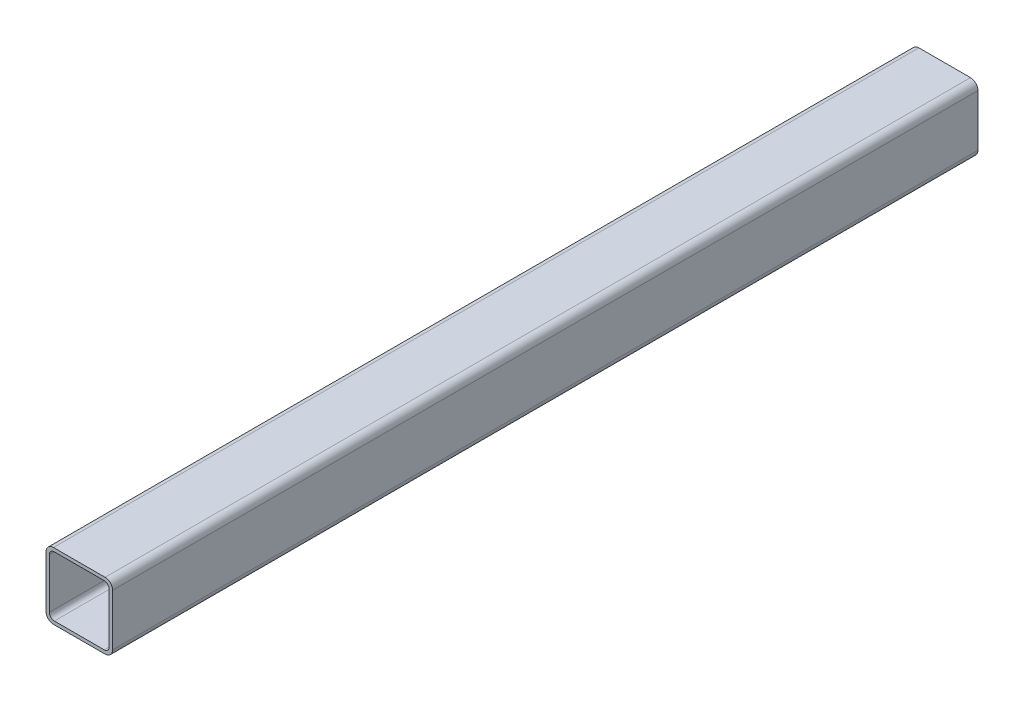
ISO-10303-21;
HEADER;
FILE_DESCRIPTION(('STEP AP214'),'2;1');
FILE_NAME('part.step','',(''),(''),'','','');
FILE_SCHEMA(('AUTOMOTIVE_DESIGN { 1 0 10303 214 1 1 1 1 }'));
ENDSEC;
DATA;
#1=APPLICATION_CONTEXT('core data for automotive mechanical design processes');
#2=APPLICATION_PROTOCOL_DEFINITION('international standard','automotive_design',2000,#1);
#3=PRODUCT_CONTEXT('',#1,'mechanical');
#4=PRODUCT('Part','Part','',(#3));
#5=PRODUCT_RELATED_PRODUCT_CATEGORY('part','',(#4));
#6=PRODUCT_DEFINITION_FORMATION('','',#4);
#7=PRODUCT_DEFINITION_CONTEXT('part definition',#1,'design');
#8=PRODUCT_DEFINITION('design','',#6,#7);
#9=PRODUCT_DEFINITION_SHAPE('','',#8);
#10=(LENGTH_UNIT() NAMED_UNIT(*) SI_UNIT(.MILLI.,.METRE.));
#11=(NAMED_UNIT(*) PLANE_ANGLE_UNIT() SI_UNIT($,.RADIAN.));
#12=(NAMED_UNIT(*) SI_UNIT($,.STERADIAN.) SOLID_ANGLE_UNIT());
#13=UNCERTAINTY_MEASURE_WITH_UNIT(LENGTH_MEASURE(1.E-05),#10,'distance_accuracy_value','');
#14=(GEOMETRIC_REPRESENTATION_CONTEXT(3) GLOBAL_UNCERTAINTY_ASSIGNED_CONTEXT((#13)) GLOBAL_UNIT_ASSIGNED_CONTEXT((#10,
#11,#12)) REPRESENTATION_CONTEXT('',''));
#15=CARTESIAN_POINT('',(0.,0.,0.));
#16=DIRECTION('',(0.,0.,1.));
#17=DIRECTION('',(1.,0.,0.));
#18=AXIS2_PLACEMENT_3D('',#15,#16,#17);
#19=CARTESIAN_POINT('',(-15.4999999999959,1289.,-2383.));
#20=DIRECTION('',(0.,-1.,0.));
#21=DIRECTION('',(0.,0.,-1.));
#22=AXIS2_PLACEMENT_3D('',#19,#20,#21);
#23=PLANE('',#22);
#24=DIRECTION('',(1.,0.,0.));
#25=VECTOR('',#24,1.);
#26=CARTESIAN_POINT('',(-15.5000000000012,1289.,-2363.));
#27=LINE('',#26,#25);
#28=CARTESIAN_POINT('',(-15.5000000000012,1289.,-2363.));
#29=VERTEX_POINT('',#28);
#30=CARTESIAN_POINT('',(15.499999999999,1289.,-2363.));
#31=VERTEX_POINT('',#30);
#32=EDGE_CURVE('E11',#29,#31,#27,.T.);
#33=ORIENTED_EDGE('',*,*,#32,.F.);
#34=DIRECTION('',(0.,0.,1.));
#35=VECTOR('',#34,1.);
#36=CARTESIAN_POINT('',(-15.4999999999959,1289.,-2383.));
#37=LINE('',#36,#35);
#38=CARTESIAN_POINT('',(-15.5000000000012,1289.,-1843.));
#39=VERTEX_POINT('',#38);
#40=EDGE_CURVE('E307',#29,#39,#37,.T.);
#41=ORIENTED_EDGE('',*,*,#40,.T.);
#42=DIRECTION('',(-1.,0.,0.));
#43=VECTOR('',#42,1.);
#44=CARTESIAN_POINT('',(-15.5000000000012,1289.,-1843.));
#45=LINE('',#44,#43);
#46=CARTESIAN_POINT('',(15.499999999999,1289.,-1843.));
#47=VERTEX_POINT('',#46);
#48=EDGE_CURVE('E246',#47,#39,#45,.T.);
#49=ORIENTED_EDGE('',*,*,#48,.F.);
#50=DIRECTION('',(0.,0.,1.));
#51=VECTOR('',#50,1.);
#52=CARTESIAN_POINT('',(15.5000000000038,1289.,-2383.));
#53=LINE('',#52,#51);
#54=EDGE_CURVE('E310',#31,#47,#53,.T.);
#55=ORIENTED_EDGE('',*,*,#54,.F.);
#56=EDGE_LOOP('',(#33,#41,#49,#55));
#57=FACE_BOUND('',#56,.T.);
#58=ADVANCED_FACE('F39',(#57),#23,.F.);
#59=CARTESIAN_POINT('',(-15.4999999999963,1284.5,-2383.));
#60=DIRECTION('',(0.,0.,1.));
#61=DIRECTION('',(1.,0.,0.));
#62=AXIS2_PLACEMENT_3D('',#59,#60,#61);
#63=CYLINDRICAL_SURFACE('',#62,4.5);
#64=CARTESIAN_POINT('',(-15.5000000000012,1284.5,-2363.));
#65=DIRECTION('',(0.,0.,-1.));
#66=DIRECTION('',(0.,1.,0.));
#67=AXIS2_PLACEMENT_3D('',#64,#65,#66);
#68=CIRCLE('',#67,4.5);
#69=CARTESIAN_POINT('',(-20.0000000000014,1284.5,-2363.));
#70=VERTEX_POINT('',#69);
#71=EDGE_CURVE('E50',#70,#29,#68,.T.);
#72=ORIENTED_EDGE('',*,*,#71,.F.);
#73=DIRECTION('',(0.,0.,1.));
#74=VECTOR('',#73,1.);
#75=CARTESIAN_POINT('',(-19.999999999996,1284.5,-2383.));
#76=LINE('',#75,#74);
#77=CARTESIAN_POINT('',(-20.0000000000014,1284.5,-1843.));
#78=VERTEX_POINT('',#77);
#79=EDGE_CURVE('E154',#70,#78,#76,.T.);
#80=ORIENTED_EDGE('',*,*,#79,.T.);
#81=CARTESIAN_POINT('',(-15.5000000000012,1284.5,-1843.));
#82=DIRECTION('',(0.,0.,1.));
#83=DIRECTION('',(0.,-1.,0.));
#84=AXIS2_PLACEMENT_3D('',#81,#82,#83);
#85=CIRCLE('',#84,4.5);
#86=EDGE_CURVE('E178',#39,#78,#85,.T.);
#87=ORIENTED_EDGE('',*,*,#86,.F.);
#88=ORIENTED_EDGE('',*,*,#40,.F.);
#89=EDGE_LOOP('',(#72,#80,#87,#88));
#90=FACE_BOUND('',#89,.T.);
#91=ADVANCED_FACE('F391',(#90),#63,.T.);
#92=CARTESIAN_POINT('',(-19.9999999999947,1253.5,-2383.));
#93=DIRECTION('',(1.,0.,0.));
#94=DIRECTION('',(0.,0.,-1.));
#95=AXIS2_PLACEMENT_3D('',#92,#93,#94);
#96=PLANE('',#95);
#97=DIRECTION('',(0.,1.,0.));
#98=VECTOR('',#97,1.);
#99=CARTESIAN_POINT('',(-20.,1.33226762955019E-12,-2363.));
#100=LINE('',#99,#98);
#101=CARTESIAN_POINT('',(-20.,1253.5,-2363.));
#102=VERTEX_POINT('',#101);
#103=EDGE_CURVE('E165',#102,#70,#100,.T.);
#104=ORIENTED_EDGE('',*,*,#103,.F.);
#105=DIRECTION('',(0.,0.,1.));
#106=VECTOR('',#105,1.);
#107=CARTESIAN_POINT('',(-19.9999999999947,1253.5,-2383.));
#108=LINE('',#107,#106);
#109=CARTESIAN_POINT('',(-19.9999999999947,1253.5,-1843.));
#110=VERTEX_POINT('',#109);
#111=EDGE_CURVE('E161',#102,#110,#108,.T.);
#112=ORIENTED_EDGE('',*,*,#111,.T.);
#113=DIRECTION('',(0.,1.,0.));
#114=VECTOR('',#113,1.);
#115=CARTESIAN_POINT('',(-20.,2.22044604925031E-13,-1843.));
#116=LINE('',#115,#114);
#117=EDGE_CURVE('E164',#110,#78,#116,.T.);
#118=ORIENTED_EDGE('',*,*,#117,.T.);
#119=ORIENTED_EDGE('',*,*,#79,.F.);
#120=EDGE_LOOP('',(#104,#112,#118,#119));
#121=FACE_BOUND('',#120,.T.);
#122=ADVANCED_FACE('F163',(#121),#96,.F.);
#123=CARTESIAN_POINT('',(-15.4999999999945,1253.5,-2383.));
#124=DIRECTION('',(0.,0.,1.));
#125=DIRECTION('',(1.,0.,0.));
#126=AXIS2_PLACEMENT_3D('',#123,#124,#125);
#127=CYLINDRICAL_SURFACE('',#126,4.5);
#128=CARTESIAN_POINT('',(-15.4999999999998,1253.5,-2363.));
#129=DIRECTION('',(0.,0.,-1.));
#130=DIRECTION('',(0.,1.,0.));
#131=AXIS2_PLACEMENT_3D('',#128,#129,#130);
#132=CIRCLE('',#131,4.5);
#133=CARTESIAN_POINT('',(-15.4999999999998,1249.,-2363.));
#134=VERTEX_POINT('',#133);
#135=EDGE_CURVE('E256',#134,#102,#132,.T.);
#136=ORIENTED_EDGE('',*,*,#135,.F.);
#137=DIRECTION('',(0.,0.,1.));
#138=VECTOR('',#137,1.);
#139=CARTESIAN_POINT('',(-15.4999999999945,1249.,-2383.));
#140=LINE('',#139,#138);
#141=CARTESIAN_POINT('',(-15.4999999999998,1249.,-1843.));
#142=VERTEX_POINT('',#141);
#143=EDGE_CURVE('E43',#134,#142,#140,.T.);
#144=ORIENTED_EDGE('',*,*,#143,.T.);
#145=CARTESIAN_POINT('',(-15.499999999995,1253.5,-1843.));
#146=DIRECTION('',(0.,0.,1.));
#147=DIRECTION('',(0.,-1.,0.));
#148=AXIS2_PLACEMENT_3D('',#145,#146,#147);
#149=CIRCLE('',#148,4.5);
#150=EDGE_CURVE('E175',#110,#142,#149,.T.);
#151=ORIENTED_EDGE('',*,*,#150,.F.);
#152=ORIENTED_EDGE('',*,*,#111,.F.);
#153=EDGE_LOOP('',(#136,#144,#151,#152));
#154=FACE_BOUND('',#153,.T.);
#155=ADVANCED_FACE('F181',(#154),#127,.T.);
#156=CARTESIAN_POINT('',(-15.4999999999945,1249.,-2383.));
#157=DIRECTION('',(0.,1.,0.));
#158=DIRECTION('',(0.,0.,1.));
#159=AXIS2_PLACEMENT_3D('',#156,#157,#158);
#160=PLANE('',#159);
#161=DIRECTION('',(-1.,0.,0.));
#162=VECTOR('',#161,1.);
#163=CARTESIAN_POINT('',(-15.4999999999998,1249.,-2363.));
#164=LINE('',#163,#162);
#165=CARTESIAN_POINT('',(15.5000000000003,1249.,-2363.));
#166=VERTEX_POINT('',#165);
#167=EDGE_CURVE('E252',#166,#134,#164,.T.);
#168=ORIENTED_EDGE('',*,*,#167,.F.);
#169=DIRECTION('',(0.,0.,1.));
#170=VECTOR('',#169,1.);
#171=CARTESIAN_POINT('',(15.5000000000052,1249.,-2383.));
#172=LINE('',#171,#170);
#173=CARTESIAN_POINT('',(15.5000000000003,1249.,-1843.));
#174=VERTEX_POINT('',#173);
#175=EDGE_CURVE('E316',#166,#174,#172,.T.);
#176=ORIENTED_EDGE('',*,*,#175,.T.);
#177=DIRECTION('',(1.,0.,0.));
#178=VECTOR('',#177,1.);
#179=CARTESIAN_POINT('',(-15.4999999999998,1249.,-1843.));
#180=LINE('',#179,#178);
#181=EDGE_CURVE('E184',#142,#174,#180,.T.);
#182=ORIENTED_EDGE('',*,*,#181,.F.);
#183=ORIENTED_EDGE('',*,*,#143,.F.);
#184=EDGE_LOOP('',(#168,#176,#182,#183));
#185=FACE_BOUND('',#184,.T.);
#186=ADVANCED_FACE('F322',(#185),#160,.F.);
#187=CARTESIAN_POINT('',(15.5000000000052,1253.5,-2383.));
#188=DIRECTION('',(0.,0.,1.));
#189=DIRECTION('',(1.,0.,0.));
#190=AXIS2_PLACEMENT_3D('',#187,#188,#189);
#191=CYLINDRICAL_SURFACE('',#190,4.5);
#192=CARTESIAN_POINT('',(15.5000000000003,1253.5,-2363.));
#193=DIRECTION('',(0.,0.,-1.));
#194=DIRECTION('',(0.,1.,0.));
#195=AXIS2_PLACEMENT_3D('',#192,#193,#194);
#196=CIRCLE('',#195,4.5);
#197=CARTESIAN_POINT('',(20.,1253.5,-2363.));
#198=VERTEX_POINT('',#197);
#199=EDGE_CURVE('E245',#198,#166,#196,.T.);
#200=ORIENTED_EDGE('',*,*,#199,.F.);
#201=DIRECTION('',(0.,0.,1.));
#202=VECTOR('',#201,1.);
#203=CARTESIAN_POINT('',(20.0000000000053,1253.5,-2383.));
#204=LINE('',#203,#202);
#205=CARTESIAN_POINT('',(20.0000000000049,1253.5,-1843.));
#206=VERTEX_POINT('',#205);
#207=EDGE_CURVE('E286',#198,#206,#204,.T.);
#208=ORIENTED_EDGE('',*,*,#207,.T.);
#209=CARTESIAN_POINT('',(15.5000000000052,1253.5,-1843.));
#210=DIRECTION('',(0.,0.,1.));
#211=DIRECTION('',(0.,-1.,0.));
#212=AXIS2_PLACEMENT_3D('',#209,#210,#211);
#213=CIRCLE('',#212,4.5);
#214=EDGE_CURVE('E189',#174,#206,#213,.T.);
#215=ORIENTED_EDGE('',*,*,#214,.F.);
#216=ORIENTED_EDGE('',*,*,#175,.F.);
#217=EDGE_LOOP('',(#200,#208,#215,#216));
#218=FACE_BOUND('',#217,.T.);
#219=ADVANCED_FACE('F327',(#218),#191,.T.);
#220=CARTESIAN_POINT('',(20.0000000000053,1253.5,-2383.));
#221=DIRECTION('',(-1.,0.,0.));
#222=DIRECTION('',(0.,0.,1.));
#223=AXIS2_PLACEMENT_3D('',#220,#221,#222);
#224=PLANE('',#223);
#225=DIRECTION('',(0.,1.,0.));
#226=VECTOR('',#225,1.);
#227=CARTESIAN_POINT('',(20.,1.55431223447522E-12,-2363.));
#228=LINE('',#227,#226);
#229=CARTESIAN_POINT('',(19.9999999999987,1284.5,-2363.));
#230=VERTEX_POINT('',#229);
#231=EDGE_CURVE('E282',#198,#230,#228,.T.);
#232=ORIENTED_EDGE('',*,*,#231,.T.);
#233=DIRECTION('',(0.,0.,1.));
#234=VECTOR('',#233,1.);
#235=CARTESIAN_POINT('',(20.000000000004,1284.5,-2383.));
#236=LINE('',#235,#234);
#237=CARTESIAN_POINT('',(19.9999999999987,1284.5,-1843.));
#238=VERTEX_POINT('',#237);
#239=EDGE_CURVE('E285',#230,#238,#236,.T.);
#240=ORIENTED_EDGE('',*,*,#239,.T.);
#241=DIRECTION('',(0.,1.,0.));
#242=VECTOR('',#241,1.);
#243=CARTESIAN_POINT('',(20.,1.33226762955019E-12,-1843.));
#244=LINE('',#243,#242);
#245=EDGE_CURVE('E199',#206,#238,#244,.T.);
#246=ORIENTED_EDGE('',*,*,#245,.F.);
#247=ORIENTED_EDGE('',*,*,#207,.F.);
#248=EDGE_LOOP('',(#232,#240,#246,#247));
#249=FACE_BOUND('',#248,.T.);
#250=ADVANCED_FACE('F330',(#249),#224,.F.);
#251=CARTESIAN_POINT('',(15.5000000000038,1284.5,-2383.));
#252=DIRECTION('',(0.,0.,1.));
#253=DIRECTION('',(1.,0.,0.));
#254=AXIS2_PLACEMENT_3D('',#251,#252,#253);
#255=CYLINDRICAL_SURFACE('',#254,4.5);
#256=CARTESIAN_POINT('',(15.4999999999985,1284.5,-2363.));
#257=DIRECTION('',(0.,0.,-1.));
#258=DIRECTION('',(0.,1.,0.));
#259=AXIS2_PLACEMENT_3D('',#256,#257,#258);
#260=CIRCLE('',#259,4.5);
#261=EDGE_CURVE('E98',#31,#230,#260,.T.);
#262=ORIENTED_EDGE('',*,*,#261,.F.);
#263=ORIENTED_EDGE('',*,*,#54,.T.);
#264=CARTESIAN_POINT('',(15.499999999999,1284.5,-1843.));
#265=DIRECTION('',(0.,0.,1.));
#266=DIRECTION('',(0.,-1.,0.));
#267=AXIS2_PLACEMENT_3D('',#264,#265,#266);
#268=CIRCLE('',#267,4.5);
#269=EDGE_CURVE('E195',#238,#47,#268,.T.);
#270=ORIENTED_EDGE('',*,*,#269,.F.);
#271=ORIENTED_EDGE('',*,*,#239,.F.);
#272=EDGE_LOOP('',(#262,#263,#270,#271));
#273=FACE_BOUND('',#272,.T.);
#274=ADVANCED_FACE('F336',(#273),#255,.T.);
#275=CARTESIAN_POINT('',(-17.9999999999945,1254.,-2383.));
#276=DIRECTION('',(1.,0.,0.));
#277=DIRECTION('',(0.,0.,-1.));
#278=AXIS2_PLACEMENT_3D('',#275,#276,#277);
#279=PLANE('',#278);
#280=DIRECTION('',(0.,0.,1.));
#281=VECTOR('',#280,1.);
#282=CARTESIAN_POINT('',(-17.9999999999945,1254.,-2383.));
#283=LINE('',#282,#281);
#284=CARTESIAN_POINT('',(-17.9999999999998,1254.,-2363.));
#285=VERTEX_POINT('',#284);
#286=CARTESIAN_POINT('',(-17.9999999999949,1254.,-1843.));
#287=VERTEX_POINT('',#286);
#288=EDGE_CURVE('E204',#285,#287,#283,.T.);
#289=ORIENTED_EDGE('',*,*,#288,.F.);
#290=DIRECTION('',(0.,1.,0.));
#291=VECTOR('',#290,1.);
#292=CARTESIAN_POINT('',(-17.9999999999998,1254.,-2363.));
#293=LINE('',#292,#291);
#294=CARTESIAN_POINT('',(-18.0000000000011,1284.,-2363.));
#295=VERTEX_POINT('',#294);
#296=EDGE_CURVE('E104',#285,#295,#293,.T.);
#297=ORIENTED_EDGE('',*,*,#296,.T.);
#298=DIRECTION('',(0.,0.,1.));
#299=VECTOR('',#298,1.);
#300=CARTESIAN_POINT('',(-17.9999999999962,1284.,-2383.));
#301=LINE('',#300,#299);
#302=CARTESIAN_POINT('',(-18.0000000000011,1284.,-1843.));
#303=VERTEX_POINT('',#302);
#304=EDGE_CURVE('E261',#295,#303,#301,.T.);
#305=ORIENTED_EDGE('',*,*,#304,.T.);
#306=DIRECTION('',(0.,-1.,0.));
#307=VECTOR('',#306,1.);
#308=CARTESIAN_POINT('',(-17.9999999999949,1254.,-1843.));
#309=LINE('',#308,#307);
#310=EDGE_CURVE('E266',#303,#287,#309,.T.);
#311=ORIENTED_EDGE('',*,*,#310,.T.);
#312=EDGE_LOOP('',(#289,#297,#305,#311));
#313=FACE_BOUND('',#312,.T.);
#314=ADVANCED_FACE('F41',(#313),#279,.T.);
#315=CARTESIAN_POINT('',(-14.9999999999961,1284.,-2383.));
#316=DIRECTION('',(0.,0.,1.));
#317=DIRECTION('',(1.,0.,0.));
#318=AXIS2_PLACEMENT_3D('',#315,#316,#317);
#319=CYLINDRICAL_SURFACE('',#318,3.);
#320=ORIENTED_EDGE('',*,*,#304,.F.);
#321=CARTESIAN_POINT('',(-15.0000000000015,1284.,-2363.));
#322=DIRECTION('',(0.,0.,-1.));
#323=DIRECTION('',(0.,1.,0.));
#324=AXIS2_PLACEMENT_3D('',#321,#322,#323);
#325=CIRCLE('',#324,3.);
#326=CARTESIAN_POINT('',(-15.0000000000015,1287.,-2363.));
#327=VERTEX_POINT('',#326);
#328=EDGE_CURVE('E262',#295,#327,#325,.T.);
#329=ORIENTED_EDGE('',*,*,#328,.T.);
#330=DIRECTION('',(0.,0.,1.));
#331=VECTOR('',#330,1.);
#332=CARTESIAN_POINT('',(-14.9999999999961,1287.,-2383.));
#333=LINE('',#332,#331);
#334=CARTESIAN_POINT('',(-15.000000000001,1287.,-1843.));
#335=VERTEX_POINT('',#334);
#336=EDGE_CURVE('E239',#327,#335,#333,.T.);
#337=ORIENTED_EDGE('',*,*,#336,.T.);
#338=CARTESIAN_POINT('',(-15.000000000001,1284.,-1843.));
#339=DIRECTION('',(0.,0.,1.));
#340=DIRECTION('',(0.,-1.,0.));
#341=AXIS2_PLACEMENT_3D('',#338,#339,#340);
#342=CIRCLE('',#341,3.);
#343=EDGE_CURVE('E235',#335,#303,#342,.T.);
#344=ORIENTED_EDGE('',*,*,#343,.T.);
#345=EDGE_LOOP('',(#320,#329,#337,#344));
#346=FACE_BOUND('',#345,.T.);
#347=ADVANCED_FACE('F361',(#346),#319,.F.);
#348=CARTESIAN_POINT('',(-14.9999999999961,1287.,-2383.));
#349=DIRECTION('',(0.,-1.,0.));
#350=DIRECTION('',(0.,0.,-1.));
#351=AXIS2_PLACEMENT_3D('',#348,#349,#350);
#352=PLANE('',#351);
#353=ORIENTED_EDGE('',*,*,#336,.F.);
#354=DIRECTION('',(1.,0.,0.));
#355=VECTOR('',#354,1.);
#356=CARTESIAN_POINT('',(-15.0000000000015,1287.,-2363.));
#357=LINE('',#356,#355);
#358=CARTESIAN_POINT('',(14.9999999999988,1287.,-2363.));
#359=VERTEX_POINT('',#358);
#360=EDGE_CURVE('E238',#327,#359,#357,.T.);
#361=ORIENTED_EDGE('',*,*,#360,.T.);
#362=DIRECTION('',(0.,0.,1.));
#363=VECTOR('',#362,1.);
#364=CARTESIAN_POINT('',(15.0000000000041,1287.,-2383.));
#365=LINE('',#364,#363);
#366=CARTESIAN_POINT('',(14.9999999999988,1287.,-1843.));
#367=VERTEX_POINT('',#366);
#368=EDGE_CURVE('E234',#359,#367,#365,.T.);
#369=ORIENTED_EDGE('',*,*,#368,.T.);
#370=DIRECTION('',(-1.,0.,0.));
#371=VECTOR('',#370,1.);
#372=CARTESIAN_POINT('',(-15.000000000001,1287.,-1843.));
#373=LINE('',#372,#371);
#374=EDGE_CURVE('E229',#367,#335,#373,.T.);
#375=ORIENTED_EDGE('',*,*,#374,.T.);
#376=EDGE_LOOP('',(#353,#361,#369,#375));
#377=FACE_BOUND('',#376,.T.);
#378=ADVANCED_FACE('F364',(#377),#352,.T.);
#379=CARTESIAN_POINT('',(15.0000000000037,1284.,-2383.));
#380=DIRECTION('',(0.,0.,1.));
#381=DIRECTION('',(1.,0.,0.));
#382=AXIS2_PLACEMENT_3D('',#379,#380,#381);
#383=CYLINDRICAL_SURFACE('',#382,3.);
#384=ORIENTED_EDGE('',*,*,#368,.F.);
#385=CARTESIAN_POINT('',(14.9999999999988,1284.,-2363.));
#386=DIRECTION('',(0.,0.,-1.));
#387=DIRECTION('',(0.,1.,0.));
#388=AXIS2_PLACEMENT_3D('',#385,#386,#387);
#389=CIRCLE('',#388,3.);
#390=CARTESIAN_POINT('',(17.9999999999989,1284.,-2363.));
#391=VERTEX_POINT('',#390);
#392=EDGE_CURVE('E233',#359,#391,#389,.T.);
#393=ORIENTED_EDGE('',*,*,#392,.T.);
#394=DIRECTION('',(0.,0.,1.));
#395=VECTOR('',#394,1.);
#396=CARTESIAN_POINT('',(18.0000000000038,1284.,-2383.));
#397=LINE('',#396,#395);
#398=CARTESIAN_POINT('',(17.9999999999989,1284.,-1843.));
#399=VERTEX_POINT('',#398);
#400=EDGE_CURVE('E228',#391,#399,#397,.T.);
#401=ORIENTED_EDGE('',*,*,#400,.T.);
#402=CARTESIAN_POINT('',(14.9999999999988,1284.,-1843.));
#403=DIRECTION('',(0.,0.,1.));
#404=DIRECTION('',(0.,-1.,0.));
#405=AXIS2_PLACEMENT_3D('',#402,#403,#404);
#406=CIRCLE('',#405,3.);
#407=EDGE_CURVE('E223',#399,#367,#406,.T.);
#408=ORIENTED_EDGE('',*,*,#407,.T.);
#409=EDGE_LOOP('',(#384,#393,#401,#408));
#410=FACE_BOUND('',#409,.T.);
#411=ADVANCED_FACE('F369',(#410),#383,.F.);
#412=CARTESIAN_POINT('',(18.0000000000056,1254.,-2383.));
#413=DIRECTION('',(-1.,0.,0.));
#414=DIRECTION('',(0.,0.,1.));
#415=AXIS2_PLACEMENT_3D('',#412,#413,#414);
#416=PLANE('',#415);
#417=ORIENTED_EDGE('',*,*,#400,.F.);
#418=DIRECTION('',(0.,-1.,0.));
#419=VECTOR('',#418,1.);
#420=CARTESIAN_POINT('',(18.0000000000002,1254.,-2363.));
#421=LINE('',#420,#419);
#422=CARTESIAN_POINT('',(18.0000000000002,1254.,-2363.));
#423=VERTEX_POINT('',#422);
#424=EDGE_CURVE('E227',#391,#423,#421,.T.);
#425=ORIENTED_EDGE('',*,*,#424,.T.);
#426=DIRECTION('',(0.,0.,1.));
#427=VECTOR('',#426,1.);
#428=CARTESIAN_POINT('',(18.0000000000056,1254.,-2383.));
#429=LINE('',#428,#427);
#430=CARTESIAN_POINT('',(18.0000000000051,1254.,-1843.));
#431=VERTEX_POINT('',#430);
#432=EDGE_CURVE('E222',#423,#431,#429,.T.);
#433=ORIENTED_EDGE('',*,*,#432,.T.);
#434=DIRECTION('',(0.,1.,0.));
#435=VECTOR('',#434,1.);
#436=CARTESIAN_POINT('',(18.0000000000051,1254.,-1843.));
#437=LINE('',#436,#435);
#438=EDGE_CURVE('E217',#431,#399,#437,.T.);
#439=ORIENTED_EDGE('',*,*,#438,.T.);
#440=EDGE_LOOP('',(#417,#425,#433,#439));
#441=FACE_BOUND('',#440,.T.);
#442=ADVANCED_FACE('F372',(#441),#416,.T.);
#443=CARTESIAN_POINT('',(15.0000000000055,1254.,-2383.));
#444=DIRECTION('',(0.,0.,1.));
#445=DIRECTION('',(1.,0.,0.));
#446=AXIS2_PLACEMENT_3D('',#443,#444,#445);
#447=CYLINDRICAL_SURFACE('',#446,3.);
#448=ORIENTED_EDGE('',*,*,#432,.F.);
#449=CARTESIAN_POINT('',(15.0000000000001,1254.,-2363.));
#450=DIRECTION('',(0.,0.,-1.));
#451=DIRECTION('',(0.,1.,0.));
#452=AXIS2_PLACEMENT_3D('',#449,#450,#451);
#453=CIRCLE('',#452,3.);
#454=CARTESIAN_POINT('',(15.0000000000001,1251.,-2363.));
#455=VERTEX_POINT('',#454);
#456=EDGE_CURVE('E221',#423,#455,#453,.T.);
#457=ORIENTED_EDGE('',*,*,#456,.T.);
#458=DIRECTION('',(0.,0.,1.));
#459=VECTOR('',#458,1.);
#460=CARTESIAN_POINT('',(15.0000000000055,1251.,-2383.));
#461=LINE('',#460,#459);
#462=CARTESIAN_POINT('',(15.0000000000001,1251.,-1843.));
#463=VERTEX_POINT('',#462);
#464=EDGE_CURVE('E216',#455,#463,#461,.T.);
#465=ORIENTED_EDGE('',*,*,#464,.T.);
#466=CARTESIAN_POINT('',(15.000000000005,1254.,-1843.));
#467=DIRECTION('',(0.,0.,1.));
#468=DIRECTION('',(0.,-1.,0.));
#469=AXIS2_PLACEMENT_3D('',#466,#467,#468);
#470=CIRCLE('',#469,3.);
#471=EDGE_CURVE('E211',#463,#431,#470,.T.);
#472=ORIENTED_EDGE('',*,*,#471,.T.);
#473=EDGE_LOOP('',(#448,#457,#465,#472));
#474=FACE_BOUND('',#473,.T.);
#475=ADVANCED_FACE('F376',(#474),#447,.F.);
#476=CARTESIAN_POINT('',(-14.9999999999948,1251.,-2383.));
#477=DIRECTION('',(0.,1.,0.));
#478=DIRECTION('',(0.,0.,1.));
#479=AXIS2_PLACEMENT_3D('',#476,#477,#478);
#480=PLANE('',#479);
#481=ORIENTED_EDGE('',*,*,#464,.F.);
#482=DIRECTION('',(-1.,0.,0.));
#483=VECTOR('',#482,1.);
#484=CARTESIAN_POINT('',(-14.9999999999997,1251.,-2363.));
#485=LINE('',#484,#483);
#486=CARTESIAN_POINT('',(-14.9999999999997,1251.,-2363.));
#487=VERTEX_POINT('',#486);
#488=EDGE_CURVE('E215',#455,#487,#485,.T.);
#489=ORIENTED_EDGE('',*,*,#488,.T.);
#490=DIRECTION('',(0.,0.,1.));
#491=VECTOR('',#490,1.);
#492=CARTESIAN_POINT('',(-14.9999999999948,1251.,-2383.));
#493=LINE('',#492,#491);
#494=CARTESIAN_POINT('',(-14.9999999999997,1251.,-1843.));
#495=VERTEX_POINT('',#494);
#496=EDGE_CURVE('E210',#487,#495,#493,.T.);
#497=ORIENTED_EDGE('',*,*,#496,.T.);
#498=DIRECTION('',(1.,0.,0.));
#499=VECTOR('',#498,1.);
#500=CARTESIAN_POINT('',(-14.9999999999997,1251.,-1843.));
#501=LINE('',#500,#499);
#502=EDGE_CURVE('E205',#495,#463,#501,.T.);
#503=ORIENTED_EDGE('',*,*,#502,.T.);
#504=EDGE_LOOP('',(#481,#489,#497,#503));
#505=FACE_BOUND('',#504,.T.);
#506=ADVANCED_FACE('F379',(#505),#480,.T.);
#507=CARTESIAN_POINT('',(-14.9999999999948,1254.,-2383.));
#508=DIRECTION('',(0.,0.,1.));
#509=DIRECTION('',(1.,0.,0.));
#510=AXIS2_PLACEMENT_3D('',#507,#508,#509);
#511=CYLINDRICAL_SURFACE('',#510,3.);
#512=ORIENTED_EDGE('',*,*,#496,.F.);
#513=CARTESIAN_POINT('',(-14.9999999999997,1254.,-2363.));
#514=DIRECTION('',(0.,0.,-1.));
#515=DIRECTION('',(0.,1.,0.));
#516=AXIS2_PLACEMENT_3D('',#513,#514,#515);
#517=CIRCLE('',#516,3.);
#518=EDGE_CURVE('E209',#487,#285,#517,.T.);
#519=ORIENTED_EDGE('',*,*,#518,.T.);
#520=ORIENTED_EDGE('',*,*,#288,.T.);
#521=CARTESIAN_POINT('',(-14.9999999999948,1254.,-1843.));
#522=DIRECTION('',(0.,0.,1.));
#523=DIRECTION('',(0.,-1.,0.));
#524=AXIS2_PLACEMENT_3D('',#521,#522,#523);
#525=CIRCLE('',#524,3.);
#526=EDGE_CURVE('E191',#287,#495,#525,.T.);
#527=ORIENTED_EDGE('',*,*,#526,.T.);
#528=EDGE_LOOP('',(#512,#519,#520,#527));
#529=FACE_BOUND('',#528,.T.);
#530=ADVANCED_FACE('F351',(#529),#511,.F.);
#531=CARTESIAN_POINT('',(-15.5000000000003,2.22044604925031E-13,-2363.));
#532=DIRECTION('',(0.,0.,-1.));
#533=DIRECTION('',(0.,1.,0.));
#534=AXIS2_PLACEMENT_3D('',#531,#532,#533);
#535=PLANE('',#534);
#536=ORIENTED_EDGE('',*,*,#518,.F.);
#537=ORIENTED_EDGE('',*,*,#488,.F.);
#538=ORIENTED_EDGE('',*,*,#456,.F.);
#539=ORIENTED_EDGE('',*,*,#424,.F.);
#540=ORIENTED_EDGE('',*,*,#392,.F.);
#541=ORIENTED_EDGE('',*,*,#360,.F.);
#542=ORIENTED_EDGE('',*,*,#328,.F.);
#543=ORIENTED_EDGE('',*,*,#296,.F.);
#544=EDGE_LOOP('',(#536,#537,#538,#539,#540,#541,#542,#543));
#545=FACE_BOUND('',#544,.T.);
#546=ORIENTED_EDGE('',*,*,#261,.T.);
#547=ORIENTED_EDGE('',*,*,#231,.F.);
#548=ORIENTED_EDGE('',*,*,#199,.T.);
#549=ORIENTED_EDGE('',*,*,#167,.T.);
#550=ORIENTED_EDGE('',*,*,#135,.T.);
#551=ORIENTED_EDGE('',*,*,#103,.T.);
#552=ORIENTED_EDGE('',*,*,#71,.T.);
#553=ORIENTED_EDGE('',*,*,#32,.T.);
#554=EDGE_LOOP('',(#546,#547,#548,#549,#550,#551,#552,#553));
#555=FACE_BOUND('',#554,.T.);
#556=ADVANCED_FACE('F380',(#545,#555),#535,.T.);
#557=CARTESIAN_POINT('',(-15.4999999999998,1.33226762955019E-12,-1843.));
#558=DIRECTION('',(0.,0.,1.));
#559=DIRECTION('',(0.,-1.,0.));
#560=AXIS2_PLACEMENT_3D('',#557,#558,#559);
#561=PLANE('',#560);
#562=ORIENTED_EDGE('',*,*,#310,.F.);
#563=ORIENTED_EDGE('',*,*,#343,.F.);
#564=ORIENTED_EDGE('',*,*,#374,.F.);
#565=ORIENTED_EDGE('',*,*,#407,.F.);
#566=ORIENTED_EDGE('',*,*,#438,.F.);
#567=ORIENTED_EDGE('',*,*,#471,.F.);
#568=ORIENTED_EDGE('',*,*,#502,.F.);
#569=ORIENTED_EDGE('',*,*,#526,.F.);
#570=EDGE_LOOP('',(#562,#563,#564,#565,#566,#567,#568,#569));
#571=FACE_BOUND('',#570,.T.);
#572=ORIENTED_EDGE('',*,*,#86,.T.);
#573=ORIENTED_EDGE('',*,*,#117,.F.);
#574=ORIENTED_EDGE('',*,*,#150,.T.);
#575=ORIENTED_EDGE('',*,*,#181,.T.);
#576=ORIENTED_EDGE('',*,*,#214,.T.);
#577=ORIENTED_EDGE('',*,*,#245,.T.);
#578=ORIENTED_EDGE('',*,*,#269,.T.);
#579=ORIENTED_EDGE('',*,*,#48,.T.);
#580=EDGE_LOOP('',(#572,#573,#574,#575,#576,#577,#578,#579));
#581=FACE_BOUND('',#580,.T.);
#582=ADVANCED_FACE('F173',(#571,#581),#561,.T.);
#583=CLOSED_SHELL('',(#58,#91,#122,#155,#186,#219,#250,#274,#314,#347,#378,#411,#442,#475,#506,
#530,#556,#582));
#584=MANIFOLD_SOLID_BREP('B2',#583);
#585=ADVANCED_BREP_SHAPE_REPRESENTATION('',(#18,#584),#14);
#586=SHAPE_DEFINITION_REPRESENTATION(#9,#585);
ENDSEC;
END-ISO-10303-21;
